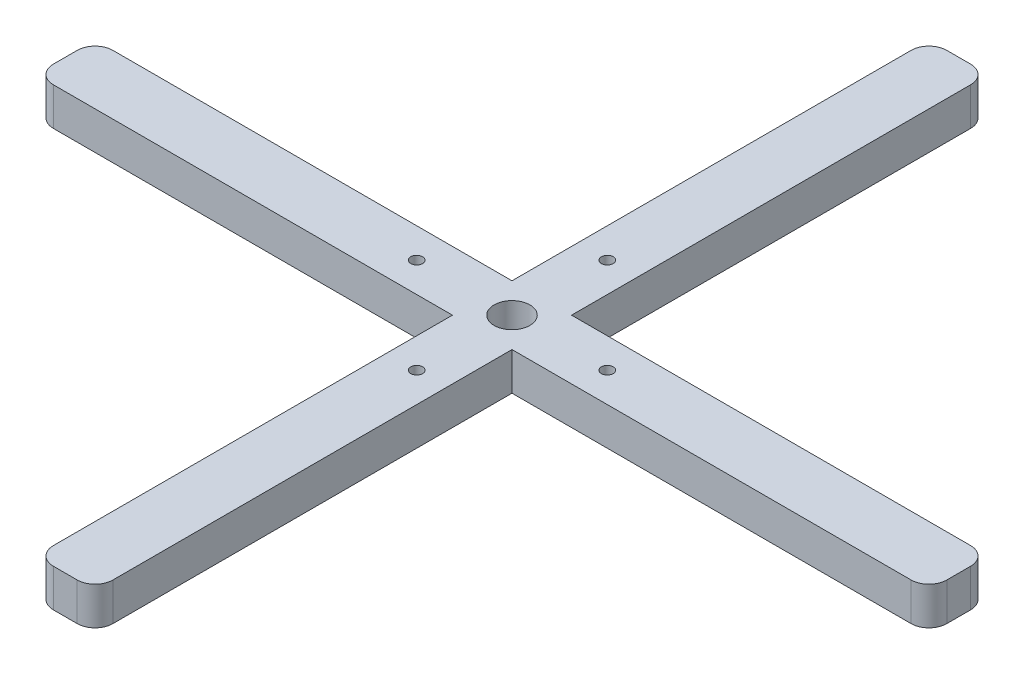
ISO-10303-21;
HEADER;
FILE_DESCRIPTION(('STEP AP214'),'2;1');
FILE_NAME('part.step','',(''),(''),'','','');
FILE_SCHEMA(('AUTOMOTIVE_DESIGN { 1 0 10303 214 1 1 1 1 }'));
ENDSEC;
DATA;
#1=APPLICATION_CONTEXT('core data for automotive mechanical design processes');
#2=APPLICATION_PROTOCOL_DEFINITION('international standard','automotive_design',2000,#1);
#3=PRODUCT_CONTEXT('',#1,'mechanical');
#4=PRODUCT('Part','Part','',(#3));
#5=PRODUCT_RELATED_PRODUCT_CATEGORY('part','',(#4));
#6=PRODUCT_DEFINITION_FORMATION('','',#4);
#7=PRODUCT_DEFINITION_CONTEXT('part definition',#1,'design');
#8=PRODUCT_DEFINITION('design','',#6,#7);
#9=PRODUCT_DEFINITION_SHAPE('','',#8);
#10=(LENGTH_UNIT() NAMED_UNIT(*) SI_UNIT(.MILLI.,.METRE.));
#11=(NAMED_UNIT(*) PLANE_ANGLE_UNIT() SI_UNIT($,.RADIAN.));
#12=(NAMED_UNIT(*) SI_UNIT($,.STERADIAN.) SOLID_ANGLE_UNIT());
#13=UNCERTAINTY_MEASURE_WITH_UNIT(LENGTH_MEASURE(1.E-05),#10,'distance_accuracy_value','');
#14=(GEOMETRIC_REPRESENTATION_CONTEXT(3) GLOBAL_UNCERTAINTY_ASSIGNED_CONTEXT((#13)) GLOBAL_UNIT_ASSIGNED_CONTEXT((#10,
#11,#12)) REPRESENTATION_CONTEXT('',''));
#15=CARTESIAN_POINT('',(0.,0.,0.));
#16=DIRECTION('',(0.,0.,1.));
#17=DIRECTION('',(1.,0.,0.));
#18=AXIS2_PLACEMENT_3D('',#15,#16,#17);
#19=CARTESIAN_POINT('',(0.,6.35,-70.));
#20=DIRECTION('',(0.,1.,0.));
#21=DIRECTION('',(0.,0.,1.));
#22=AXIS2_PLACEMENT_3D('',#19,#20,#21);
#23=PLANE('',#22);
#24=DIRECTION('',(0.,0.,1.));
#25=VECTOR('',#24,1.);
#26=CARTESIAN_POINT('',(70.,6.35,-70.));
#27=LINE('',#26,#25);
#28=CARTESIAN_POINT('',(70.,6.35,-70.));
#29=VERTEX_POINT('',#28);
#30=CARTESIAN_POINT('',(70.,6.35,-3.));
#31=VERTEX_POINT('',#30);
#32=EDGE_CURVE('E179',#29,#31,#27,.T.);
#33=ORIENTED_EDGE('',*,*,#32,.T.);
#34=CARTESIAN_POINT('',(73.,6.35,-3.));
#35=DIRECTION('',(0.,1.,0.));
#36=DIRECTION('',(0.,0.,1.));
#37=AXIS2_PLACEMENT_3D('',#34,#35,#36);
#38=CIRCLE('',#37,3.);
#39=CARTESIAN_POINT('',(73.,6.35,0.));
#40=VERTEX_POINT('',#39);
#41=EDGE_CURVE('E311',#31,#40,#38,.T.);
#42=ORIENTED_EDGE('',*,*,#41,.T.);
#43=DIRECTION('',(1.,0.,0.));
#44=VECTOR('',#43,1.);
#45=CARTESIAN_POINT('',(70.,6.35,0.));
#46=LINE('',#45,#44);
#47=CARTESIAN_POINT('',(77.,6.35,0.));
#48=VERTEX_POINT('',#47);
#49=EDGE_CURVE('E202',#40,#48,#46,.T.);
#50=ORIENTED_EDGE('',*,*,#49,.T.);
#51=CARTESIAN_POINT('',(77.,6.35,-3.));
#52=DIRECTION('',(0.,1.,0.));
#53=DIRECTION('',(0.,0.,1.));
#54=AXIS2_PLACEMENT_3D('',#51,#52,#53);
#55=CIRCLE('',#54,3.);
#56=CARTESIAN_POINT('',(80.,6.35,-3.));
#57=VERTEX_POINT('',#56);
#58=EDGE_CURVE('E309',#48,#57,#55,.T.);
#59=ORIENTED_EDGE('',*,*,#58,.T.);
#60=DIRECTION('',(0.,0.,-1.));
#61=VECTOR('',#60,1.);
#62=CARTESIAN_POINT('',(80.,6.35,-70.));
#63=LINE('',#62,#61);
#64=CARTESIAN_POINT('',(80.,6.35,-70.));
#65=VERTEX_POINT('',#64);
#66=EDGE_CURVE('E205',#57,#65,#63,.T.);
#67=ORIENTED_EDGE('',*,*,#66,.T.);
#68=DIRECTION('',(1.,0.,0.));
#69=VECTOR('',#68,1.);
#70=CARTESIAN_POINT('',(80.,6.35,-70.));
#71=LINE('',#70,#69);
#72=CARTESIAN_POINT('',(147.,6.35,-70.));
#73=VERTEX_POINT('',#72);
#74=EDGE_CURVE('E210',#65,#73,#71,.T.);
#75=ORIENTED_EDGE('',*,*,#74,.T.);
#76=CARTESIAN_POINT('',(147.,6.35,-73.));
#77=DIRECTION('',(0.,1.,0.));
#78=DIRECTION('',(0.,0.,1.));
#79=AXIS2_PLACEMENT_3D('',#76,#77,#78);
#80=CIRCLE('',#79,3.);
#81=CARTESIAN_POINT('',(150.,6.35,-73.));
#82=VERTEX_POINT('',#81);
#83=EDGE_CURVE('E307',#73,#82,#80,.T.);
#84=ORIENTED_EDGE('',*,*,#83,.T.);
#85=DIRECTION('',(0.,0.,-1.));
#86=VECTOR('',#85,1.);
#87=CARTESIAN_POINT('',(150.,6.35,-80.));
#88=LINE('',#87,#86);
#89=CARTESIAN_POINT('',(150.,6.35,-77.));
#90=VERTEX_POINT('',#89);
#91=EDGE_CURVE('E213',#82,#90,#88,.T.);
#92=ORIENTED_EDGE('',*,*,#91,.T.);
#93=CARTESIAN_POINT('',(147.,6.35,-77.));
#94=DIRECTION('',(0.,1.,0.));
#95=DIRECTION('',(0.,0.,1.));
#96=AXIS2_PLACEMENT_3D('',#93,#94,#95);
#97=CIRCLE('',#96,3.);
#98=CARTESIAN_POINT('',(147.,6.35,-80.));
#99=VERTEX_POINT('',#98);
#100=EDGE_CURVE('E305',#90,#99,#97,.T.);
#101=ORIENTED_EDGE('',*,*,#100,.T.);
#102=DIRECTION('',(-1.,0.,0.));
#103=VECTOR('',#102,1.);
#104=CARTESIAN_POINT('',(80.,6.35,-80.));
#105=LINE('',#104,#103);
#106=CARTESIAN_POINT('',(80.,6.35,-80.));
#107=VERTEX_POINT('',#106);
#108=EDGE_CURVE('E216',#99,#107,#105,.T.);
#109=ORIENTED_EDGE('',*,*,#108,.T.);
#110=DIRECTION('',(0.,0.,-1.));
#111=VECTOR('',#110,1.);
#112=CARTESIAN_POINT('',(80.,6.35,-150.));
#113=LINE('',#112,#111);
#114=CARTESIAN_POINT('',(80.,6.35,-147.));
#115=VERTEX_POINT('',#114);
#116=EDGE_CURVE('E218',#107,#115,#113,.T.);
#117=ORIENTED_EDGE('',*,*,#116,.T.);
#118=CARTESIAN_POINT('',(77.,6.35,-147.));
#119=DIRECTION('',(0.,1.,0.));
#120=DIRECTION('',(0.,0.,1.));
#121=AXIS2_PLACEMENT_3D('',#118,#119,#120);
#122=CIRCLE('',#121,3.);
#123=CARTESIAN_POINT('',(77.,6.35,-150.));
#124=VERTEX_POINT('',#123);
#125=EDGE_CURVE('E303',#115,#124,#122,.T.);
#126=ORIENTED_EDGE('',*,*,#125,.T.);
#127=DIRECTION('',(-1.,0.,0.));
#128=VECTOR('',#127,1.);
#129=CARTESIAN_POINT('',(70.,6.35,-150.));
#130=LINE('',#129,#128);
#131=CARTESIAN_POINT('',(73.,6.35,-150.));
#132=VERTEX_POINT('',#131);
#133=EDGE_CURVE('E221',#124,#132,#130,.T.);
#134=ORIENTED_EDGE('',*,*,#133,.T.);
#135=CARTESIAN_POINT('',(73.,6.35,-147.));
#136=DIRECTION('',(0.,1.,0.));
#137=DIRECTION('',(0.,0.,1.));
#138=AXIS2_PLACEMENT_3D('',#135,#136,#137);
#139=CIRCLE('',#138,3.);
#140=CARTESIAN_POINT('',(70.,6.35,-147.));
#141=VERTEX_POINT('',#140);
#142=EDGE_CURVE('E59',#132,#141,#139,.T.);
#143=ORIENTED_EDGE('',*,*,#142,.T.);
#144=DIRECTION('',(0.,0.,1.));
#145=VECTOR('',#144,1.);
#146=CARTESIAN_POINT('',(70.,6.35,-150.));
#147=LINE('',#146,#145);
#148=CARTESIAN_POINT('',(70.,6.35,-80.));
#149=VERTEX_POINT('',#148);
#150=EDGE_CURVE('E223',#141,#149,#147,.T.);
#151=ORIENTED_EDGE('',*,*,#150,.T.);
#152=DIRECTION('',(-1.,0.,0.));
#153=VECTOR('',#152,1.);
#154=CARTESIAN_POINT('',(0.,6.35,-80.));
#155=LINE('',#154,#153);
#156=CARTESIAN_POINT('',(3.,6.35,-80.));
#157=VERTEX_POINT('',#156);
#158=EDGE_CURVE('E225',#149,#157,#155,.T.);
#159=ORIENTED_EDGE('',*,*,#158,.T.);
#160=CARTESIAN_POINT('',(3.,6.35,-77.));
#161=DIRECTION('',(0.,1.,0.));
#162=DIRECTION('',(0.,0.,1.));
#163=AXIS2_PLACEMENT_3D('',#160,#161,#162);
#164=CIRCLE('',#163,3.);
#165=CARTESIAN_POINT('',(0.,6.35,-77.));
#166=VERTEX_POINT('',#165);
#167=EDGE_CURVE('E300',#157,#166,#164,.T.);
#168=ORIENTED_EDGE('',*,*,#167,.T.);
#169=DIRECTION('',(0.,0.,1.));
#170=VECTOR('',#169,1.);
#171=CARTESIAN_POINT('',(0.,6.35,-80.));
#172=LINE('',#171,#170);
#173=CARTESIAN_POINT('',(0.,6.35,-73.));
#174=VERTEX_POINT('',#173);
#175=EDGE_CURVE('E186',#166,#174,#172,.T.);
#176=ORIENTED_EDGE('',*,*,#175,.T.);
#177=CARTESIAN_POINT('',(3.,6.35,-73.));
#178=DIRECTION('',(0.,1.,0.));
#179=DIRECTION('',(0.,0.,1.));
#180=AXIS2_PLACEMENT_3D('',#177,#178,#179);
#181=CIRCLE('',#180,3.);
#182=CARTESIAN_POINT('',(3.,6.35,-70.));
#183=VERTEX_POINT('',#182);
#184=EDGE_CURVE('E183',#174,#183,#181,.T.);
#185=ORIENTED_EDGE('',*,*,#184,.T.);
#186=DIRECTION('',(1.,0.,0.));
#187=VECTOR('',#186,1.);
#188=CARTESIAN_POINT('',(0.,6.35,-70.));
#189=LINE('',#188,#187);
#190=EDGE_CURVE('E175',#183,#29,#189,.T.);
#191=ORIENTED_EDGE('',*,*,#190,.T.);
#192=EDGE_LOOP('',(#33,#42,#50,#59,#67,#75,#84,#92,#101,#109,#117,#126,#134,#143,#151,#159,#168,
#176,#185,#191));
#193=FACE_BOUND('',#192,.T.);
#194=CARTESIAN_POINT('',(91.,6.35,-75.));
#195=DIRECTION('',(0.,1.,0.));
#196=DIRECTION('',(0.,0.,1.));
#197=AXIS2_PLACEMENT_3D('',#194,#195,#196);
#198=CIRCLE('',#197,0.996949999999996);
#199=CARTESIAN_POINT('',(91.,6.35,-74.00305));
#200=VERTEX_POINT('',#199);
#201=EDGE_CURVE('E268',#200,#200,#198,.T.);
#202=ORIENTED_EDGE('',*,*,#201,.F.);
#203=EDGE_LOOP('',(#202));
#204=FACE_BOUND('',#203,.T.);
#205=CARTESIAN_POINT('',(75.,6.35,-59.));
#206=DIRECTION('',(0.,1.,0.));
#207=DIRECTION('',(0.,0.,1.));
#208=AXIS2_PLACEMENT_3D('',#205,#206,#207);
#209=CIRCLE('',#208,0.996949999999996);
#210=CARTESIAN_POINT('',(75.,6.35,-58.00305));
#211=VERTEX_POINT('',#210);
#212=EDGE_CURVE('E269',#211,#211,#209,.T.);
#213=ORIENTED_EDGE('',*,*,#212,.F.);
#214=EDGE_LOOP('',(#213));
#215=FACE_BOUND('',#214,.T.);
#216=CARTESIAN_POINT('',(59.,6.35,-75.));
#217=DIRECTION('',(0.,1.,0.));
#218=DIRECTION('',(0.,0.,1.));
#219=AXIS2_PLACEMENT_3D('',#216,#217,#218);
#220=CIRCLE('',#219,0.996949999999996);
#221=CARTESIAN_POINT('',(59.,6.35,-74.00305));
#222=VERTEX_POINT('',#221);
#223=EDGE_CURVE('E273',#222,#222,#220,.T.);
#224=ORIENTED_EDGE('',*,*,#223,.F.);
#225=EDGE_LOOP('',(#224));
#226=FACE_BOUND('',#225,.T.);
#227=CARTESIAN_POINT('',(75.,6.35,-91.));
#228=DIRECTION('',(0.,1.,0.));
#229=DIRECTION('',(0.,0.,1.));
#230=AXIS2_PLACEMENT_3D('',#227,#228,#229);
#231=CIRCLE('',#230,0.996949999999996);
#232=CARTESIAN_POINT('',(75.,6.35,-90.00305));
#233=VERTEX_POINT('',#232);
#234=EDGE_CURVE('E277',#233,#233,#231,.T.);
#235=ORIENTED_EDGE('',*,*,#234,.F.);
#236=EDGE_LOOP('',(#235));
#237=FACE_BOUND('',#236,.T.);
#238=CARTESIAN_POINT('',(75.,6.35,-75.));
#239=DIRECTION('',(0.,1.,0.));
#240=DIRECTION('',(0.,0.,1.));
#241=AXIS2_PLACEMENT_3D('',#238,#239,#240);
#242=CIRCLE('',#241,3.00000000000001);
#243=CARTESIAN_POINT('',(75.,6.35,-72.));
#244=VERTEX_POINT('',#243);
#245=EDGE_CURVE('E365',#244,#244,#242,.T.);
#246=ORIENTED_EDGE('',*,*,#245,.F.);
#247=EDGE_LOOP('',(#246));
#248=FACE_BOUND('',#247,.T.);
#249=ADVANCED_FACE('F37',(#193,#204,#215,#226,#237,#248),#23,.T.);
#250=CARTESIAN_POINT('',(0.,0.,-70.));
#251=DIRECTION('',(0.,1.,0.));
#252=DIRECTION('',(0.,0.,1.));
#253=AXIS2_PLACEMENT_3D('',#250,#251,#252);
#254=PLANE('',#253);
#255=DIRECTION('',(1.,0.,0.));
#256=VECTOR('',#255,1.);
#257=CARTESIAN_POINT('',(70.,0.,0.));
#258=LINE('',#257,#256);
#259=CARTESIAN_POINT('',(73.,0.,0.));
#260=VERTEX_POINT('',#259);
#261=CARTESIAN_POINT('',(77.,0.,0.));
#262=VERTEX_POINT('',#261);
#263=EDGE_CURVE('E235',#260,#262,#258,.T.);
#264=ORIENTED_EDGE('',*,*,#263,.F.);
#265=CARTESIAN_POINT('',(73.,0.,-3.));
#266=DIRECTION('',(0.,1.,0.));
#267=DIRECTION('',(0.,0.,1.));
#268=AXIS2_PLACEMENT_3D('',#265,#266,#267);
#269=CIRCLE('',#268,3.);
#270=CARTESIAN_POINT('',(70.,0.,-3.));
#271=VERTEX_POINT('',#270);
#272=EDGE_CURVE('E296',#260,#271,#269,.F.);
#273=ORIENTED_EDGE('',*,*,#272,.T.);
#274=DIRECTION('',(0.,0.,1.));
#275=VECTOR('',#274,1.);
#276=CARTESIAN_POINT('',(70.,0.,-70.));
#277=LINE('',#276,#275);
#278=CARTESIAN_POINT('',(70.,0.,-70.));
#279=VERTEX_POINT('',#278);
#280=EDGE_CURVE('E233',#279,#271,#277,.T.);
#281=ORIENTED_EDGE('',*,*,#280,.F.);
#282=DIRECTION('',(1.,0.,0.));
#283=VECTOR('',#282,1.);
#284=CARTESIAN_POINT('',(0.,0.,-70.));
#285=LINE('',#284,#283);
#286=CARTESIAN_POINT('',(3.,0.,-70.));
#287=VERTEX_POINT('',#286);
#288=EDGE_CURVE('E192',#287,#279,#285,.T.);
#289=ORIENTED_EDGE('',*,*,#288,.F.);
#290=CARTESIAN_POINT('',(3.,0.,-73.));
#291=DIRECTION('',(0.,1.,0.));
#292=DIRECTION('',(0.,0.,1.));
#293=AXIS2_PLACEMENT_3D('',#290,#291,#292);
#294=CIRCLE('',#293,3.);
#295=CARTESIAN_POINT('',(0.,0.,-73.));
#296=VERTEX_POINT('',#295);
#297=EDGE_CURVE('E282',#287,#296,#294,.F.);
#298=ORIENTED_EDGE('',*,*,#297,.T.);
#299=DIRECTION('',(0.,0.,1.));
#300=VECTOR('',#299,1.);
#301=CARTESIAN_POINT('',(0.,0.,-80.));
#302=LINE('',#301,#300);
#303=CARTESIAN_POINT('',(0.,0.,-77.));
#304=VERTEX_POINT('',#303);
#305=EDGE_CURVE('E228',#304,#296,#302,.T.);
#306=ORIENTED_EDGE('',*,*,#305,.F.);
#307=CARTESIAN_POINT('',(3.,0.,-77.));
#308=DIRECTION('',(0.,1.,0.));
#309=DIRECTION('',(0.,0.,1.));
#310=AXIS2_PLACEMENT_3D('',#307,#308,#309);
#311=CIRCLE('',#310,3.);
#312=CARTESIAN_POINT('',(3.,0.,-80.));
#313=VERTEX_POINT('',#312);
#314=EDGE_CURVE('E284',#304,#313,#311,.F.);
#315=ORIENTED_EDGE('',*,*,#314,.T.);
#316=DIRECTION('',(-1.,0.,0.));
#317=VECTOR('',#316,1.);
#318=CARTESIAN_POINT('',(0.,0.,-80.));
#319=LINE('',#318,#317);
#320=CARTESIAN_POINT('',(70.,0.,-80.));
#321=VERTEX_POINT('',#320);
#322=EDGE_CURVE('E256',#321,#313,#319,.T.);
#323=ORIENTED_EDGE('',*,*,#322,.F.);
#324=DIRECTION('',(0.,0.,1.));
#325=VECTOR('',#324,1.);
#326=CARTESIAN_POINT('',(70.,0.,-150.));
#327=LINE('',#326,#325);
#328=CARTESIAN_POINT('',(70.,0.,-147.));
#329=VERTEX_POINT('',#328);
#330=EDGE_CURVE('E254',#329,#321,#327,.T.);
#331=ORIENTED_EDGE('',*,*,#330,.F.);
#332=CARTESIAN_POINT('',(73.,0.,-147.));
#333=DIRECTION('',(0.,1.,0.));
#334=DIRECTION('',(0.,0.,1.));
#335=AXIS2_PLACEMENT_3D('',#332,#333,#334);
#336=CIRCLE('',#335,3.);
#337=CARTESIAN_POINT('',(73.,0.,-150.));
#338=VERTEX_POINT('',#337);
#339=EDGE_CURVE('E286',#329,#338,#336,.F.);
#340=ORIENTED_EDGE('',*,*,#339,.T.);
#341=DIRECTION('',(-1.,0.,0.));
#342=VECTOR('',#341,1.);
#343=CARTESIAN_POINT('',(70.,0.,-150.));
#344=LINE('',#343,#342);
#345=CARTESIAN_POINT('',(77.,0.,-150.));
#346=VERTEX_POINT('',#345);
#347=EDGE_CURVE('E251',#346,#338,#344,.T.);
#348=ORIENTED_EDGE('',*,*,#347,.F.);
#349=CARTESIAN_POINT('',(77.,0.,-147.));
#350=DIRECTION('',(0.,1.,0.));
#351=DIRECTION('',(0.,0.,1.));
#352=AXIS2_PLACEMENT_3D('',#349,#350,#351);
#353=CIRCLE('',#352,3.);
#354=CARTESIAN_POINT('',(80.,0.,-147.));
#355=VERTEX_POINT('',#354);
#356=EDGE_CURVE('E288',#346,#355,#353,.F.);
#357=ORIENTED_EDGE('',*,*,#356,.T.);
#358=DIRECTION('',(0.,0.,-1.));
#359=VECTOR('',#358,1.);
#360=CARTESIAN_POINT('',(80.,0.,-150.));
#361=LINE('',#360,#359);
#362=CARTESIAN_POINT('',(80.,0.,-80.));
#363=VERTEX_POINT('',#362);
#364=EDGE_CURVE('E248',#363,#355,#361,.T.);
#365=ORIENTED_EDGE('',*,*,#364,.F.);
#366=DIRECTION('',(-1.,0.,0.));
#367=VECTOR('',#366,1.);
#368=CARTESIAN_POINT('',(80.,0.,-80.));
#369=LINE('',#368,#367);
#370=CARTESIAN_POINT('',(147.,0.,-80.));
#371=VERTEX_POINT('',#370);
#372=EDGE_CURVE('E246',#371,#363,#369,.T.);
#373=ORIENTED_EDGE('',*,*,#372,.F.);
#374=CARTESIAN_POINT('',(147.,0.,-77.));
#375=DIRECTION('',(0.,1.,0.));
#376=DIRECTION('',(0.,0.,1.));
#377=AXIS2_PLACEMENT_3D('',#374,#375,#376);
#378=CIRCLE('',#377,3.);
#379=CARTESIAN_POINT('',(150.,0.,-77.));
#380=VERTEX_POINT('',#379);
#381=EDGE_CURVE('E290',#371,#380,#378,.F.);
#382=ORIENTED_EDGE('',*,*,#381,.T.);
#383=DIRECTION('',(0.,0.,-1.));
#384=VECTOR('',#383,1.);
#385=CARTESIAN_POINT('',(150.,0.,-80.));
#386=LINE('',#385,#384);
#387=CARTESIAN_POINT('',(150.,0.,-73.));
#388=VERTEX_POINT('',#387);
#389=EDGE_CURVE('E243',#388,#380,#386,.T.);
#390=ORIENTED_EDGE('',*,*,#389,.F.);
#391=CARTESIAN_POINT('',(147.,0.,-73.));
#392=DIRECTION('',(0.,1.,0.));
#393=DIRECTION('',(0.,0.,1.));
#394=AXIS2_PLACEMENT_3D('',#391,#392,#393);
#395=CIRCLE('',#394,3.);
#396=CARTESIAN_POINT('',(147.,0.,-70.));
#397=VERTEX_POINT('',#396);
#398=EDGE_CURVE('E292',#388,#397,#395,.F.);
#399=ORIENTED_EDGE('',*,*,#398,.T.);
#400=DIRECTION('',(1.,0.,0.));
#401=VECTOR('',#400,1.);
#402=CARTESIAN_POINT('',(80.,0.,-70.));
#403=LINE('',#402,#401);
#404=CARTESIAN_POINT('',(80.,0.,-70.));
#405=VERTEX_POINT('',#404);
#406=EDGE_CURVE('E240',#405,#397,#403,.T.);
#407=ORIENTED_EDGE('',*,*,#406,.F.);
#408=DIRECTION('',(0.,0.,-1.));
#409=VECTOR('',#408,1.);
#410=CARTESIAN_POINT('',(80.,0.,-70.));
#411=LINE('',#410,#409);
#412=CARTESIAN_POINT('',(80.,0.,-3.));
#413=VERTEX_POINT('',#412);
#414=EDGE_CURVE('E238',#413,#405,#411,.T.);
#415=ORIENTED_EDGE('',*,*,#414,.F.);
#416=CARTESIAN_POINT('',(77.,0.,-3.));
#417=DIRECTION('',(0.,1.,0.));
#418=DIRECTION('',(0.,0.,1.));
#419=AXIS2_PLACEMENT_3D('',#416,#417,#418);
#420=CIRCLE('',#419,3.);
#421=EDGE_CURVE('E294',#413,#262,#420,.F.);
#422=ORIENTED_EDGE('',*,*,#421,.T.);
#423=EDGE_LOOP('',(#264,#273,#281,#289,#298,#306,#315,#323,#331,#340,#348,#357,#365,#373,#382,
#390,#399,#407,#415,#422));
#424=FACE_BOUND('',#423,.T.);
#425=CARTESIAN_POINT('',(91.,0.,-75.));
#426=DIRECTION('',(0.,1.,0.));
#427=DIRECTION('',(0.,0.,1.));
#428=AXIS2_PLACEMENT_3D('',#425,#426,#427);
#429=CIRCLE('',#428,0.996949999999996);
#430=CARTESIAN_POINT('',(91.,0.,-74.00305));
#431=VERTEX_POINT('',#430);
#432=EDGE_CURVE('E231',#431,#431,#429,.T.);
#433=ORIENTED_EDGE('',*,*,#432,.T.);
#434=EDGE_LOOP('',(#433));
#435=FACE_BOUND('',#434,.T.);
#436=CARTESIAN_POINT('',(75.,0.,-59.));
#437=DIRECTION('',(0.,1.,0.));
#438=DIRECTION('',(0.,0.,1.));
#439=AXIS2_PLACEMENT_3D('',#436,#437,#438);
#440=CIRCLE('',#439,0.996949999999996);
#441=CARTESIAN_POINT('',(75.,0.,-58.00305));
#442=VERTEX_POINT('',#441);
#443=EDGE_CURVE('E265',#442,#442,#440,.T.);
#444=ORIENTED_EDGE('',*,*,#443,.T.);
#445=EDGE_LOOP('',(#444));
#446=FACE_BOUND('',#445,.T.);
#447=CARTESIAN_POINT('',(59.,0.,-75.));
#448=DIRECTION('',(0.,1.,0.));
#449=DIRECTION('',(0.,0.,1.));
#450=AXIS2_PLACEMENT_3D('',#447,#448,#449);
#451=CIRCLE('',#450,0.996949999999996);
#452=CARTESIAN_POINT('',(59.,0.,-74.00305));
#453=VERTEX_POINT('',#452);
#454=EDGE_CURVE('E270',#453,#453,#451,.T.);
#455=ORIENTED_EDGE('',*,*,#454,.T.);
#456=EDGE_LOOP('',(#455));
#457=FACE_BOUND('',#456,.T.);
#458=CARTESIAN_POINT('',(75.,0.,-91.));
#459=DIRECTION('',(0.,1.,0.));
#460=DIRECTION('',(0.,0.,1.));
#461=AXIS2_PLACEMENT_3D('',#458,#459,#460);
#462=CIRCLE('',#461,0.996949999999996);
#463=CARTESIAN_POINT('',(75.,0.,-90.00305));
#464=VERTEX_POINT('',#463);
#465=EDGE_CURVE('E274',#464,#464,#462,.T.);
#466=ORIENTED_EDGE('',*,*,#465,.T.);
#467=EDGE_LOOP('',(#466));
#468=FACE_BOUND('',#467,.T.);
#469=CARTESIAN_POINT('',(75.,0.,-75.));
#470=DIRECTION('',(0.,1.,0.));
#471=DIRECTION('',(0.,0.,1.));
#472=AXIS2_PLACEMENT_3D('',#469,#470,#471);
#473=CIRCLE('',#472,3.00000000000001);
#474=CARTESIAN_POINT('',(75.,0.,-72.));
#475=VERTEX_POINT('',#474);
#476=EDGE_CURVE('E366',#475,#475,#473,.T.);
#477=ORIENTED_EDGE('',*,*,#476,.T.);
#478=EDGE_LOOP('',(#477));
#479=FACE_BOUND('',#478,.T.);
#480=ADVANCED_FACE('F350',(#424,#435,#446,#457,#468,#479),#254,.F.);
#481=CARTESIAN_POINT('',(0.,6.35,-80.));
#482=DIRECTION('',(1.,0.,0.));
#483=DIRECTION('',(0.,0.,-1.));
#484=AXIS2_PLACEMENT_3D('',#481,#482,#483);
#485=PLANE('',#484);
#486=ORIENTED_EDGE('',*,*,#175,.F.);
#487=DIRECTION('',(0.,-1.,0.));
#488=VECTOR('',#487,1.);
#489=CARTESIAN_POINT('',(0.,6.35,-77.));
#490=LINE('',#489,#488);
#491=EDGE_CURVE('E338',#166,#304,#490,.T.);
#492=ORIENTED_EDGE('',*,*,#491,.T.);
#493=ORIENTED_EDGE('',*,*,#305,.T.);
#494=DIRECTION('',(0.,-1.,0.));
#495=VECTOR('',#494,1.);
#496=CARTESIAN_POINT('',(0.,6.35,-73.));
#497=LINE('',#496,#495);
#498=EDGE_CURVE('E336',#296,#174,#497,.F.);
#499=ORIENTED_EDGE('',*,*,#498,.T.);
#500=EDGE_LOOP('',(#486,#492,#493,#499));
#501=FACE_BOUND('',#500,.T.);
#502=ADVANCED_FACE('F344',(#501),#485,.F.);
#503=CARTESIAN_POINT('',(0.,6.35,-70.));
#504=DIRECTION('',(0.,0.,-1.));
#505=DIRECTION('',(-1.,0.,0.));
#506=AXIS2_PLACEMENT_3D('',#503,#504,#505);
#507=PLANE('',#506);
#508=ORIENTED_EDGE('',*,*,#190,.F.);
#509=DIRECTION('',(0.,-1.,0.));
#510=VECTOR('',#509,1.);
#511=CARTESIAN_POINT('',(3.,6.35,-70.));
#512=LINE('',#511,#510);
#513=EDGE_CURVE('E11',#183,#287,#512,.T.);
#514=ORIENTED_EDGE('',*,*,#513,.T.);
#515=ORIENTED_EDGE('',*,*,#288,.T.);
#516=DIRECTION('',(0.,-1.,0.));
#517=VECTOR('',#516,1.);
#518=CARTESIAN_POINT('',(70.,6.35,-70.));
#519=LINE('',#518,#517);
#520=EDGE_CURVE('E189',#29,#279,#519,.T.);
#521=ORIENTED_EDGE('',*,*,#520,.F.);
#522=EDGE_LOOP('',(#508,#514,#515,#521));
#523=FACE_BOUND('',#522,.T.);
#524=ADVANCED_FACE('F190',(#523),#507,.F.);
#525=CARTESIAN_POINT('',(70.,6.35,-70.));
#526=DIRECTION('',(1.,0.,0.));
#527=DIRECTION('',(0.,0.,-1.));
#528=AXIS2_PLACEMENT_3D('',#525,#526,#527);
#529=PLANE('',#528);
#530=ORIENTED_EDGE('',*,*,#280,.T.);
#531=DIRECTION('',(0.,-1.,0.));
#532=VECTOR('',#531,1.);
#533=CARTESIAN_POINT('',(70.,6.35,-3.));
#534=LINE('',#533,#532);
#535=EDGE_CURVE('E201',#271,#31,#534,.F.);
#536=ORIENTED_EDGE('',*,*,#535,.T.);
#537=ORIENTED_EDGE('',*,*,#32,.F.);
#538=ORIENTED_EDGE('',*,*,#520,.T.);
#539=EDGE_LOOP('',(#530,#536,#537,#538));
#540=FACE_BOUND('',#539,.T.);
#541=ADVANCED_FACE('F199',(#540),#529,.F.);
#542=CARTESIAN_POINT('',(70.,6.35,0.));
#543=DIRECTION('',(0.,0.,-1.));
#544=DIRECTION('',(-1.,0.,0.));
#545=AXIS2_PLACEMENT_3D('',#542,#543,#544);
#546=PLANE('',#545);
#547=ORIENTED_EDGE('',*,*,#49,.F.);
#548=DIRECTION('',(0.,-1.,0.));
#549=VECTOR('',#548,1.);
#550=CARTESIAN_POINT('',(73.,6.35,0.));
#551=LINE('',#550,#549);
#552=EDGE_CURVE('E279',#40,#260,#551,.T.);
#553=ORIENTED_EDGE('',*,*,#552,.T.);
#554=ORIENTED_EDGE('',*,*,#263,.T.);
#555=DIRECTION('',(0.,-1.,0.));
#556=VECTOR('',#555,1.);
#557=CARTESIAN_POINT('',(77.,6.35,0.));
#558=LINE('',#557,#556);
#559=EDGE_CURVE('E196',#262,#48,#558,.F.);
#560=ORIENTED_EDGE('',*,*,#559,.T.);
#561=EDGE_LOOP('',(#547,#553,#554,#560));
#562=FACE_BOUND('',#561,.T.);
#563=ADVANCED_FACE('F415',(#562),#546,.F.);
#564=CARTESIAN_POINT('',(80.,6.35,-70.));
#565=DIRECTION('',(-1.,0.,0.));
#566=DIRECTION('',(0.,0.,1.));
#567=AXIS2_PLACEMENT_3D('',#564,#565,#566);
#568=PLANE('',#567);
#569=ORIENTED_EDGE('',*,*,#66,.F.);
#570=DIRECTION('',(0.,-1.,0.));
#571=VECTOR('',#570,1.);
#572=CARTESIAN_POINT('',(80.,6.35,-3.));
#573=LINE('',#572,#571);
#574=EDGE_CURVE('E313',#57,#413,#573,.T.);
#575=ORIENTED_EDGE('',*,*,#574,.T.);
#576=ORIENTED_EDGE('',*,*,#414,.T.);
#577=DIRECTION('',(0.,-1.,0.));
#578=VECTOR('',#577,1.);
#579=CARTESIAN_POINT('',(80.,6.35,-70.));
#580=LINE('',#579,#578);
#581=EDGE_CURVE('E197',#65,#405,#580,.T.);
#582=ORIENTED_EDGE('',*,*,#581,.F.);
#583=EDGE_LOOP('',(#569,#575,#576,#582));
#584=FACE_BOUND('',#583,.T.);
#585=ADVANCED_FACE('F411',(#584),#568,.F.);
#586=CARTESIAN_POINT('',(80.,6.35,-70.));
#587=DIRECTION('',(0.,0.,-1.));
#588=DIRECTION('',(-1.,0.,0.));
#589=AXIS2_PLACEMENT_3D('',#586,#587,#588);
#590=PLANE('',#589);
#591=ORIENTED_EDGE('',*,*,#406,.T.);
#592=DIRECTION('',(0.,-1.,0.));
#593=VECTOR('',#592,1.);
#594=CARTESIAN_POINT('',(147.,6.35,-70.));
#595=LINE('',#594,#593);
#596=EDGE_CURVE('E321',#397,#73,#595,.F.);
#597=ORIENTED_EDGE('',*,*,#596,.T.);
#598=ORIENTED_EDGE('',*,*,#74,.F.);
#599=ORIENTED_EDGE('',*,*,#581,.T.);
#600=EDGE_LOOP('',(#591,#597,#598,#599));
#601=FACE_BOUND('',#600,.T.);
#602=ADVANCED_FACE('F407',(#601),#590,.F.);
#603=CARTESIAN_POINT('',(150.,6.35,-80.));
#604=DIRECTION('',(-1.,0.,0.));
#605=DIRECTION('',(0.,0.,1.));
#606=AXIS2_PLACEMENT_3D('',#603,#604,#605);
#607=PLANE('',#606);
#608=ORIENTED_EDGE('',*,*,#91,.F.);
#609=DIRECTION('',(0.,-1.,0.));
#610=VECTOR('',#609,1.);
#611=CARTESIAN_POINT('',(150.,6.35,-73.));
#612=LINE('',#611,#610);
#613=EDGE_CURVE('E318',#82,#388,#612,.T.);
#614=ORIENTED_EDGE('',*,*,#613,.T.);
#615=ORIENTED_EDGE('',*,*,#389,.T.);
#616=DIRECTION('',(0.,-1.,0.));
#617=VECTOR('',#616,1.);
#618=CARTESIAN_POINT('',(150.,6.35,-77.));
#619=LINE('',#618,#617);
#620=EDGE_CURVE('E316',#380,#90,#619,.F.);
#621=ORIENTED_EDGE('',*,*,#620,.T.);
#622=EDGE_LOOP('',(#608,#614,#615,#621));
#623=FACE_BOUND('',#622,.T.);
#624=ADVANCED_FACE('F403',(#623),#607,.F.);
#625=CARTESIAN_POINT('',(80.,6.35,-80.));
#626=DIRECTION('',(0.,0.,1.));
#627=DIRECTION('',(1.,0.,0.));
#628=AXIS2_PLACEMENT_3D('',#625,#626,#627);
#629=PLANE('',#628);
#630=ORIENTED_EDGE('',*,*,#108,.F.);
#631=DIRECTION('',(0.,-1.,0.));
#632=VECTOR('',#631,1.);
#633=CARTESIAN_POINT('',(147.,6.35,-80.));
#634=LINE('',#633,#632);
#635=EDGE_CURVE('E323',#99,#371,#634,.T.);
#636=ORIENTED_EDGE('',*,*,#635,.T.);
#637=ORIENTED_EDGE('',*,*,#372,.T.);
#638=DIRECTION('',(0.,-1.,0.));
#639=VECTOR('',#638,1.);
#640=CARTESIAN_POINT('',(80.,6.35,-80.));
#641=LINE('',#640,#639);
#642=EDGE_CURVE('E260',#107,#363,#641,.T.);
#643=ORIENTED_EDGE('',*,*,#642,.F.);
#644=EDGE_LOOP('',(#630,#636,#637,#643));
#645=FACE_BOUND('',#644,.T.);
#646=ADVANCED_FACE('F399',(#645),#629,.F.);
#647=CARTESIAN_POINT('',(80.,6.35,-150.));
#648=DIRECTION('',(-1.,0.,0.));
#649=DIRECTION('',(0.,0.,1.));
#650=AXIS2_PLACEMENT_3D('',#647,#648,#649);
#651=PLANE('',#650);
#652=ORIENTED_EDGE('',*,*,#364,.T.);
#653=DIRECTION('',(0.,-1.,0.));
#654=VECTOR('',#653,1.);
#655=CARTESIAN_POINT('',(80.,6.35,-147.));
#656=LINE('',#655,#654);
#657=EDGE_CURVE('E331',#355,#115,#656,.F.);
#658=ORIENTED_EDGE('',*,*,#657,.T.);
#659=ORIENTED_EDGE('',*,*,#116,.F.);
#660=ORIENTED_EDGE('',*,*,#642,.T.);
#661=EDGE_LOOP('',(#652,#658,#659,#660));
#662=FACE_BOUND('',#661,.T.);
#663=ADVANCED_FACE('F395',(#662),#651,.F.);
#664=CARTESIAN_POINT('',(70.,6.35,-150.));
#665=DIRECTION('',(0.,0.,1.));
#666=DIRECTION('',(1.,0.,0.));
#667=AXIS2_PLACEMENT_3D('',#664,#665,#666);
#668=PLANE('',#667);
#669=ORIENTED_EDGE('',*,*,#133,.F.);
#670=DIRECTION('',(0.,-1.,0.));
#671=VECTOR('',#670,1.);
#672=CARTESIAN_POINT('',(77.,6.35,-150.));
#673=LINE('',#672,#671);
#674=EDGE_CURVE('E328',#124,#346,#673,.T.);
#675=ORIENTED_EDGE('',*,*,#674,.T.);
#676=ORIENTED_EDGE('',*,*,#347,.T.);
#677=DIRECTION('',(0.,-1.,0.));
#678=VECTOR('',#677,1.);
#679=CARTESIAN_POINT('',(73.,6.35,-150.));
#680=LINE('',#679,#678);
#681=EDGE_CURVE('E326',#338,#132,#680,.F.);
#682=ORIENTED_EDGE('',*,*,#681,.T.);
#683=EDGE_LOOP('',(#669,#675,#676,#682));
#684=FACE_BOUND('',#683,.T.);
#685=ADVANCED_FACE('F391',(#684),#668,.F.);
#686=CARTESIAN_POINT('',(70.,6.35,-150.));
#687=DIRECTION('',(1.,0.,0.));
#688=DIRECTION('',(0.,0.,-1.));
#689=AXIS2_PLACEMENT_3D('',#686,#687,#688);
#690=PLANE('',#689);
#691=ORIENTED_EDGE('',*,*,#150,.F.);
#692=DIRECTION('',(0.,-1.,0.));
#693=VECTOR('',#692,1.);
#694=CARTESIAN_POINT('',(70.,6.35,-147.));
#695=LINE('',#694,#693);
#696=EDGE_CURVE('E333',#141,#329,#695,.T.);
#697=ORIENTED_EDGE('',*,*,#696,.T.);
#698=ORIENTED_EDGE('',*,*,#330,.T.);
#699=DIRECTION('',(0.,-1.,0.));
#700=VECTOR('',#699,1.);
#701=CARTESIAN_POINT('',(70.,6.35,-80.));
#702=LINE('',#701,#700);
#703=EDGE_CURVE('E227',#149,#321,#702,.T.);
#704=ORIENTED_EDGE('',*,*,#703,.F.);
#705=EDGE_LOOP('',(#691,#697,#698,#704));
#706=FACE_BOUND('',#705,.T.);
#707=ADVANCED_FACE('F388',(#706),#690,.F.);
#708=CARTESIAN_POINT('',(0.,6.35,-80.));
#709=DIRECTION('',(0.,0.,1.));
#710=DIRECTION('',(1.,0.,0.));
#711=AXIS2_PLACEMENT_3D('',#708,#709,#710);
#712=PLANE('',#711);
#713=ORIENTED_EDGE('',*,*,#322,.T.);
#714=DIRECTION('',(0.,-1.,0.));
#715=VECTOR('',#714,1.);
#716=CARTESIAN_POINT('',(3.,6.35,-80.));
#717=LINE('',#716,#715);
#718=EDGE_CURVE('E45',#313,#157,#717,.F.);
#719=ORIENTED_EDGE('',*,*,#718,.T.);
#720=ORIENTED_EDGE('',*,*,#158,.F.);
#721=ORIENTED_EDGE('',*,*,#703,.T.);
#722=EDGE_LOOP('',(#713,#719,#720,#721));
#723=FACE_BOUND('',#722,.T.);
#724=ADVANCED_FACE('F385',(#723),#712,.F.);
#725=CARTESIAN_POINT('',(91.,6.35,-75.));
#726=DIRECTION('',(0.,1.,0.));
#727=DIRECTION('',(0.,0.,1.));
#728=AXIS2_PLACEMENT_3D('',#725,#726,#727);
#729=CYLINDRICAL_SURFACE('',#728,0.996949999999996);
#730=ORIENTED_EDGE('',*,*,#201,.T.);
#731=EDGE_LOOP('',(#730));
#732=FACE_BOUND('',#731,.T.);
#733=ORIENTED_EDGE('',*,*,#432,.F.);
#734=EDGE_LOOP('',(#733));
#735=FACE_BOUND('',#734,.T.);
#736=ADVANCED_FACE('F382',(#732,#735),#729,.F.);
#737=CARTESIAN_POINT('',(75.,6.35,-59.));
#738=DIRECTION('',(0.,1.,0.));
#739=DIRECTION('',(0.,0.,1.));
#740=AXIS2_PLACEMENT_3D('',#737,#738,#739);
#741=CYLINDRICAL_SURFACE('',#740,0.996949999999996);
#742=ORIENTED_EDGE('',*,*,#212,.T.);
#743=EDGE_LOOP('',(#742));
#744=FACE_BOUND('',#743,.T.);
#745=ORIENTED_EDGE('',*,*,#443,.F.);
#746=EDGE_LOOP('',(#745));
#747=FACE_BOUND('',#746,.T.);
#748=ADVANCED_FACE('F467',(#744,#747),#741,.F.);
#749=CARTESIAN_POINT('',(59.,6.35,-75.));
#750=DIRECTION('',(0.,1.,0.));
#751=DIRECTION('',(0.,0.,1.));
#752=AXIS2_PLACEMENT_3D('',#749,#750,#751);
#753=CYLINDRICAL_SURFACE('',#752,0.996949999999996);
#754=ORIENTED_EDGE('',*,*,#223,.T.);
#755=EDGE_LOOP('',(#754));
#756=FACE_BOUND('',#755,.T.);
#757=ORIENTED_EDGE('',*,*,#454,.F.);
#758=EDGE_LOOP('',(#757));
#759=FACE_BOUND('',#758,.T.);
#760=ADVANCED_FACE('F464',(#756,#759),#753,.F.);
#761=CARTESIAN_POINT('',(75.,6.35,-91.));
#762=DIRECTION('',(0.,1.,0.));
#763=DIRECTION('',(0.,0.,1.));
#764=AXIS2_PLACEMENT_3D('',#761,#762,#763);
#765=CYLINDRICAL_SURFACE('',#764,0.996949999999996);
#766=ORIENTED_EDGE('',*,*,#234,.T.);
#767=EDGE_LOOP('',(#766));
#768=FACE_BOUND('',#767,.T.);
#769=ORIENTED_EDGE('',*,*,#465,.F.);
#770=EDGE_LOOP('',(#769));
#771=FACE_BOUND('',#770,.T.);
#772=ADVANCED_FACE('F430',(#768,#771),#765,.F.);
#773=CARTESIAN_POINT('',(73.,6.35,-3.));
#774=DIRECTION('',(0.,-1.,0.));
#775=DIRECTION('',(0.,0.,-1.));
#776=AXIS2_PLACEMENT_3D('',#773,#774,#775);
#777=CYLINDRICAL_SURFACE('',#776,3.);
#778=ORIENTED_EDGE('',*,*,#41,.F.);
#779=ORIENTED_EDGE('',*,*,#535,.F.);
#780=ORIENTED_EDGE('',*,*,#272,.F.);
#781=ORIENTED_EDGE('',*,*,#552,.F.);
#782=EDGE_LOOP('',(#778,#779,#780,#781));
#783=FACE_BOUND('',#782,.T.);
#784=ADVANCED_FACE('F426',(#783),#777,.T.);
#785=CARTESIAN_POINT('',(77.,6.35,-3.));
#786=DIRECTION('',(0.,-1.,0.));
#787=DIRECTION('',(0.,0.,-1.));
#788=AXIS2_PLACEMENT_3D('',#785,#786,#787);
#789=CYLINDRICAL_SURFACE('',#788,3.);
#790=ORIENTED_EDGE('',*,*,#58,.F.);
#791=ORIENTED_EDGE('',*,*,#559,.F.);
#792=ORIENTED_EDGE('',*,*,#421,.F.);
#793=ORIENTED_EDGE('',*,*,#574,.F.);
#794=EDGE_LOOP('',(#790,#791,#792,#793));
#795=FACE_BOUND('',#794,.T.);
#796=ADVANCED_FACE('F429',(#795),#789,.T.);
#797=CARTESIAN_POINT('',(147.,6.35,-73.));
#798=DIRECTION('',(0.,-1.,0.));
#799=DIRECTION('',(0.,0.,-1.));
#800=AXIS2_PLACEMENT_3D('',#797,#798,#799);
#801=CYLINDRICAL_SURFACE('',#800,3.);
#802=ORIENTED_EDGE('',*,*,#83,.F.);
#803=ORIENTED_EDGE('',*,*,#596,.F.);
#804=ORIENTED_EDGE('',*,*,#398,.F.);
#805=ORIENTED_EDGE('',*,*,#613,.F.);
#806=EDGE_LOOP('',(#802,#803,#804,#805));
#807=FACE_BOUND('',#806,.T.);
#808=ADVANCED_FACE('F434',(#807),#801,.T.);
#809=CARTESIAN_POINT('',(147.,6.35,-77.));
#810=DIRECTION('',(0.,-1.,0.));
#811=DIRECTION('',(0.,0.,-1.));
#812=AXIS2_PLACEMENT_3D('',#809,#810,#811);
#813=CYLINDRICAL_SURFACE('',#812,3.);
#814=ORIENTED_EDGE('',*,*,#100,.F.);
#815=ORIENTED_EDGE('',*,*,#620,.F.);
#816=ORIENTED_EDGE('',*,*,#381,.F.);
#817=ORIENTED_EDGE('',*,*,#635,.F.);
#818=EDGE_LOOP('',(#814,#815,#816,#817));
#819=FACE_BOUND('',#818,.T.);
#820=ADVANCED_FACE('F438',(#819),#813,.T.);
#821=CARTESIAN_POINT('',(77.,6.35,-147.));
#822=DIRECTION('',(0.,-1.,0.));
#823=DIRECTION('',(0.,0.,-1.));
#824=AXIS2_PLACEMENT_3D('',#821,#822,#823);
#825=CYLINDRICAL_SURFACE('',#824,3.);
#826=ORIENTED_EDGE('',*,*,#125,.F.);
#827=ORIENTED_EDGE('',*,*,#657,.F.);
#828=ORIENTED_EDGE('',*,*,#356,.F.);
#829=ORIENTED_EDGE('',*,*,#674,.F.);
#830=EDGE_LOOP('',(#826,#827,#828,#829));
#831=FACE_BOUND('',#830,.T.);
#832=ADVANCED_FACE('F442',(#831),#825,.T.);
#833=CARTESIAN_POINT('',(73.,6.35,-147.));
#834=DIRECTION('',(0.,-1.,0.));
#835=DIRECTION('',(0.,0.,-1.));
#836=AXIS2_PLACEMENT_3D('',#833,#834,#835);
#837=CYLINDRICAL_SURFACE('',#836,3.);
#838=ORIENTED_EDGE('',*,*,#142,.F.);
#839=ORIENTED_EDGE('',*,*,#681,.F.);
#840=ORIENTED_EDGE('',*,*,#339,.F.);
#841=ORIENTED_EDGE('',*,*,#696,.F.);
#842=EDGE_LOOP('',(#838,#839,#840,#841));
#843=FACE_BOUND('',#842,.T.);
#844=ADVANCED_FACE('F446',(#843),#837,.T.);
#845=CARTESIAN_POINT('',(3.,6.35,-77.));
#846=DIRECTION('',(0.,-1.,0.));
#847=DIRECTION('',(0.,0.,-1.));
#848=AXIS2_PLACEMENT_3D('',#845,#846,#847);
#849=CYLINDRICAL_SURFACE('',#848,3.);
#850=ORIENTED_EDGE('',*,*,#167,.F.);
#851=ORIENTED_EDGE('',*,*,#718,.F.);
#852=ORIENTED_EDGE('',*,*,#314,.F.);
#853=ORIENTED_EDGE('',*,*,#491,.F.);
#854=EDGE_LOOP('',(#850,#851,#852,#853));
#855=FACE_BOUND('',#854,.T.);
#856=ADVANCED_FACE('F449',(#855),#849,.T.);
#857=CARTESIAN_POINT('',(3.,6.35,-73.));
#858=DIRECTION('',(0.,-1.,0.));
#859=DIRECTION('',(0.,0.,-1.));
#860=AXIS2_PLACEMENT_3D('',#857,#858,#859);
#861=CYLINDRICAL_SURFACE('',#860,3.);
#862=ORIENTED_EDGE('',*,*,#184,.F.);
#863=ORIENTED_EDGE('',*,*,#498,.F.);
#864=ORIENTED_EDGE('',*,*,#297,.F.);
#865=ORIENTED_EDGE('',*,*,#513,.F.);
#866=EDGE_LOOP('',(#862,#863,#864,#865));
#867=FACE_BOUND('',#866,.T.);
#868=ADVANCED_FACE('F39',(#867),#861,.T.);
#869=CARTESIAN_POINT('',(75.,6.35,-75.));
#870=DIRECTION('',(0.,-1.,0.));
#871=DIRECTION('',(0.,0.,-1.));
#872=AXIS2_PLACEMENT_3D('',#869,#870,#871);
#873=CYLINDRICAL_SURFACE('',#872,3.00000000000001);
#874=ORIENTED_EDGE('',*,*,#245,.T.);
#875=EDGE_LOOP('',(#874));
#876=FACE_BOUND('',#875,.T.);
#877=ORIENTED_EDGE('',*,*,#476,.F.);
#878=EDGE_LOOP('',(#877));
#879=FACE_BOUND('',#878,.T.);
#880=ADVANCED_FACE('F372',(#876,#879),#873,.F.);
#881=CLOSED_SHELL('',(#249,#480,#502,#524,#541,#563,#585,#602,#624,#646,#663,#685,#707,#724,
#736,#748,#760,#772,#784,#796,#808,#820,#832,#844,#856,#868,#880));
#882=MANIFOLD_SOLID_BREP('B2',#881);
#883=ADVANCED_BREP_SHAPE_REPRESENTATION('',(#18,#882),#14);
#884=SHAPE_DEFINITION_REPRESENTATION(#9,#883);
ENDSEC;
END-ISO-10303-21;
